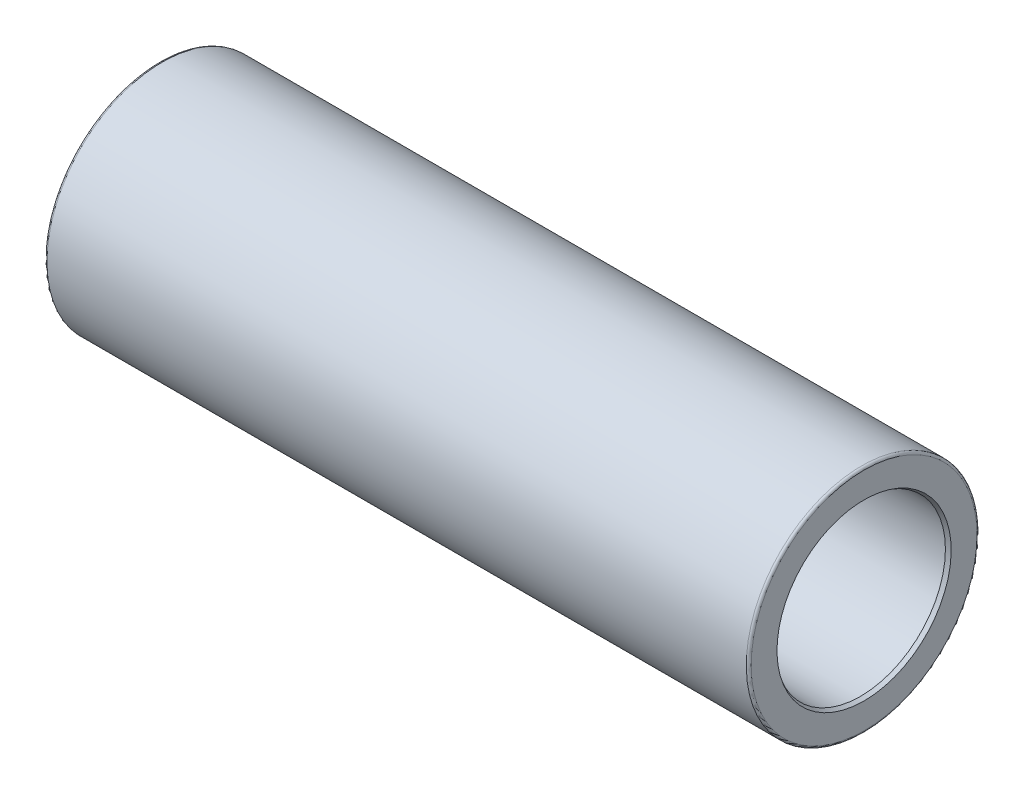
ISO-10303-21;
HEADER;
FILE_DESCRIPTION(('STEP AP214'),'2;1');
FILE_NAME('part.step','',(''),(''),'','','');
FILE_SCHEMA(('AUTOMOTIVE_DESIGN { 1 0 10303 214 1 1 1 1 }'));
ENDSEC;
DATA;
#1=APPLICATION_CONTEXT('core data for automotive mechanical design processes');
#2=APPLICATION_PROTOCOL_DEFINITION('international standard','automotive_design',2000,#1);
#3=PRODUCT_CONTEXT('',#1,'mechanical');
#4=PRODUCT('Part','Part','',(#3));
#5=PRODUCT_RELATED_PRODUCT_CATEGORY('part','',(#4));
#6=PRODUCT_DEFINITION_FORMATION('','',#4);
#7=PRODUCT_DEFINITION_CONTEXT('part definition',#1,'design');
#8=PRODUCT_DEFINITION('design','',#6,#7);
#9=PRODUCT_DEFINITION_SHAPE('','',#8);
#10=(LENGTH_UNIT() NAMED_UNIT(*) SI_UNIT(.MILLI.,.METRE.));
#11=(NAMED_UNIT(*) PLANE_ANGLE_UNIT() SI_UNIT($,.RADIAN.));
#12=(NAMED_UNIT(*) SI_UNIT($,.STERADIAN.) SOLID_ANGLE_UNIT());
#13=UNCERTAINTY_MEASURE_WITH_UNIT(LENGTH_MEASURE(1.E-05),#10,'distance_accuracy_value','');
#14=(GEOMETRIC_REPRESENTATION_CONTEXT(3) GLOBAL_UNCERTAINTY_ASSIGNED_CONTEXT((#13)) GLOBAL_UNIT_ASSIGNED_CONTEXT((#10,
#11,#12)) REPRESENTATION_CONTEXT('',''));
#15=CARTESIAN_POINT('',(0.,0.,0.));
#16=DIRECTION('',(0.,0.,1.));
#17=DIRECTION('',(1.,0.,0.));
#18=AXIS2_PLACEMENT_3D('',#15,#16,#17);
#19=CARTESIAN_POINT('',(-145.,0.,0.));
#20=DIRECTION('',(-1.,0.,0.));
#21=DIRECTION('',(0.,-1.,0.));
#22=AXIS2_PLACEMENT_3D('',#19,#20,#21);
#23=CYLINDRICAL_SURFACE('',#22,35.);
#24=CARTESIAN_POINT('',(-65.,0.,0.));
#25=DIRECTION('',(-1.,0.,0.));
#26=DIRECTION('',(0.,-1.,0.));
#27=AXIS2_PLACEMENT_3D('',#24,#25,#26);
#28=CIRCLE('',#27,35.);
#29=CARTESIAN_POINT('',(-65.,-35.,0.));
#30=VERTEX_POINT('',#29);
#31=EDGE_CURVE('E10',#30,#30,#28,.T.);
#32=ORIENTED_EDGE('',*,*,#31,.F.);
#33=EDGE_LOOP('',(#32));
#34=FACE_BOUND('',#33,.T.);
#35=CARTESIAN_POINT('',(-143.5,0.,0.));
#36=DIRECTION('',(-1.,0.,0.));
#37=DIRECTION('',(0.,-1.,0.));
#38=AXIS2_PLACEMENT_3D('',#35,#36,#37);
#39=CIRCLE('',#38,35.);
#40=CARTESIAN_POINT('',(-143.5,-35.,0.));
#41=VERTEX_POINT('',#40);
#42=EDGE_CURVE('E80',#41,#41,#39,.T.);
#43=ORIENTED_EDGE('',*,*,#42,.T.);
#44=EDGE_LOOP('',(#43));
#45=FACE_BOUND('',#44,.T.);
#46=ADVANCED_FACE('F37',(#34,#45),#23,.F.);
#47=CARTESIAN_POINT('',(-145.,35.,0.));
#48=DIRECTION('',(-1.,0.,0.));
#49=DIRECTION('',(0.,-1.,0.));
#50=AXIS2_PLACEMENT_3D('',#47,#48,#49);
#51=PLANE('',#50);
#52=CARTESIAN_POINT('',(-145.,0.,0.));
#53=DIRECTION('',(-1.,0.,0.));
#54=DIRECTION('',(0.,-1.,0.));
#55=AXIS2_PLACEMENT_3D('',#52,#53,#54);
#56=CIRCLE('',#55,46.5);
#57=CARTESIAN_POINT('',(-145.,-46.5,0.));
#58=VERTEX_POINT('',#57);
#59=EDGE_CURVE('E71',#58,#58,#56,.T.);
#60=ORIENTED_EDGE('',*,*,#59,.T.);
#61=EDGE_LOOP('',(#60));
#62=FACE_BOUND('',#61,.T.);
#63=CARTESIAN_POINT('',(-145.,0.,0.));
#64=DIRECTION('',(-1.,0.,0.));
#65=DIRECTION('',(0.,-1.,0.));
#66=AXIS2_PLACEMENT_3D('',#63,#64,#65);
#67=CIRCLE('',#66,35.8660254037845);
#68=CARTESIAN_POINT('',(-145.,-35.8660254037845,0.));
#69=VERTEX_POINT('',#68);
#70=EDGE_CURVE('E83',#69,#69,#67,.T.);
#71=ORIENTED_EDGE('',*,*,#70,.F.);
#72=EDGE_LOOP('',(#71));
#73=FACE_BOUND('',#72,.T.);
#74=ADVANCED_FACE('F90',(#62,#73),#51,.T.);
#75=CARTESIAN_POINT('',(-145.,0.,0.));
#76=DIRECTION('',(-1.,0.,0.));
#77=DIRECTION('',(0.,-1.,0.));
#78=AXIS2_PLACEMENT_3D('',#75,#76,#77);
#79=CYLINDRICAL_SURFACE('',#78,35.);
#80=CARTESIAN_POINT('',(65.,0.,0.));
#81=DIRECTION('',(-1.,0.,0.));
#82=DIRECTION('',(0.,-1.,0.));
#83=AXIS2_PLACEMENT_3D('',#80,#81,#82);
#84=CIRCLE('',#83,35.);
#85=CARTESIAN_POINT('',(65.,-35.,0.));
#86=VERTEX_POINT('',#85);
#87=EDGE_CURVE('E59',#86,#86,#84,.T.);
#88=ORIENTED_EDGE('',*,*,#87,.T.);
#89=EDGE_LOOP('',(#88));
#90=FACE_BOUND('',#89,.T.);
#91=CARTESIAN_POINT('',(143.5,0.,0.));
#92=DIRECTION('',(-1.,0.,0.));
#93=DIRECTION('',(0.,-1.,0.));
#94=AXIS2_PLACEMENT_3D('',#91,#92,#93);
#95=CIRCLE('',#94,35.);
#96=CARTESIAN_POINT('',(143.5,-35.,0.));
#97=VERTEX_POINT('',#96);
#98=EDGE_CURVE('E77',#97,#97,#95,.T.);
#99=ORIENTED_EDGE('',*,*,#98,.F.);
#100=EDGE_LOOP('',(#99));
#101=FACE_BOUND('',#100,.T.);
#102=ADVANCED_FACE('F92',(#90,#101),#79,.F.);
#103=CARTESIAN_POINT('',(145.,35.,0.));
#104=DIRECTION('',(-1.,0.,0.));
#105=DIRECTION('',(0.,-1.,0.));
#106=AXIS2_PLACEMENT_3D('',#103,#104,#105);
#107=PLANE('',#106);
#108=CARTESIAN_POINT('',(145.,0.,0.));
#109=DIRECTION('',(-1.,0.,0.));
#110=DIRECTION('',(0.,-1.,0.));
#111=AXIS2_PLACEMENT_3D('',#108,#109,#110);
#112=CIRCLE('',#111,46.5);
#113=CARTESIAN_POINT('',(145.,-46.5,0.));
#114=VERTEX_POINT('',#113);
#115=EDGE_CURVE('E62',#114,#114,#112,.T.);
#116=ORIENTED_EDGE('',*,*,#115,.F.);
#117=EDGE_LOOP('',(#116));
#118=FACE_BOUND('',#117,.T.);
#119=CARTESIAN_POINT('',(145.,0.,0.));
#120=DIRECTION('',(-1.,0.,0.));
#121=DIRECTION('',(0.,-1.,0.));
#122=AXIS2_PLACEMENT_3D('',#119,#120,#121);
#123=CIRCLE('',#122,35.8660254037845);
#124=CARTESIAN_POINT('',(145.,-35.8660254037845,0.));
#125=VERTEX_POINT('',#124);
#126=EDGE_CURVE('E74',#125,#125,#123,.T.);
#127=ORIENTED_EDGE('',*,*,#126,.T.);
#128=EDGE_LOOP('',(#127));
#129=FACE_BOUND('',#128,.T.);
#130=ADVANCED_FACE('F99',(#118,#129),#107,.F.);
#131=CARTESIAN_POINT('',(-65.,0.,0.));
#132=DIRECTION('',(1.,0.,0.));
#133=DIRECTION('',(0.,1.,0.));
#134=AXIS2_PLACEMENT_3D('',#131,#132,#133);
#135=CONICAL_SURFACE('',#134,35.,0.349065850398866);
#136=CARTESIAN_POINT('',(-58.2969996139807,0.,0.));
#137=DIRECTION('',(-1.,0.,0.));
#138=DIRECTION('',(0.,-1.,0.));
#139=AXIS2_PLACEMENT_3D('',#136,#137,#138);
#140=CIRCLE('',#139,37.4396926207859);
#141=CARTESIAN_POINT('',(-58.2969996139807,-37.4396926207859,0.));
#142=VERTEX_POINT('',#141);
#143=EDGE_CURVE('E43',#142,#142,#140,.T.);
#144=ORIENTED_EDGE('',*,*,#143,.F.);
#145=EDGE_LOOP('',(#144));
#146=FACE_BOUND('',#145,.T.);
#147=ORIENTED_EDGE('',*,*,#31,.T.);
#148=EDGE_LOOP('',(#147));
#149=FACE_BOUND('',#148,.T.);
#150=ADVANCED_FACE('F121',(#146,#149),#135,.F.);
#151=CARTESIAN_POINT('',(-57.954979470655,0.,0.));
#152=DIRECTION('',(-1.,0.,0.));
#153=DIRECTION('',(0.,-1.,0.));
#154=AXIS2_PLACEMENT_3D('',#151,#152,#153);
#155=TOROIDAL_SURFACE('',#154,36.5,1.);
#156=ORIENTED_EDGE('',*,*,#143,.T.);
#157=EDGE_LOOP('',(#156));
#158=FACE_BOUND('',#157,.T.);
#159=CARTESIAN_POINT('',(-57.954979470655,0.,0.));
#160=DIRECTION('',(-1.,0.,0.));
#161=DIRECTION('',(0.,-1.,0.));
#162=AXIS2_PLACEMENT_3D('',#159,#160,#161);
#163=CIRCLE('',#162,37.5);
#164=CARTESIAN_POINT('',(-57.954979470655,-37.5,0.));
#165=VERTEX_POINT('',#164);
#166=EDGE_CURVE('E47',#165,#165,#163,.T.);
#167=ORIENTED_EDGE('',*,*,#166,.F.);
#168=EDGE_LOOP('',(#167));
#169=FACE_BOUND('',#168,.T.);
#170=ADVANCED_FACE('F134',(#158,#169),#155,.F.);
#171=CARTESIAN_POINT('',(-145.,0.,0.));
#172=DIRECTION('',(-1.,0.,0.));
#173=DIRECTION('',(0.,-1.,0.));
#174=AXIS2_PLACEMENT_3D('',#171,#172,#173);
#175=CYLINDRICAL_SURFACE('',#174,37.5);
#176=CARTESIAN_POINT('',(57.954979470655,0.,0.));
#177=DIRECTION('',(-1.,0.,0.));
#178=DIRECTION('',(0.,-1.,0.));
#179=AXIS2_PLACEMENT_3D('',#176,#177,#178);
#180=CIRCLE('',#179,37.5);
#181=CARTESIAN_POINT('',(57.954979470655,-37.5,0.));
#182=VERTEX_POINT('',#181);
#183=EDGE_CURVE('E51',#182,#182,#180,.T.);
#184=ORIENTED_EDGE('',*,*,#183,.F.);
#185=EDGE_LOOP('',(#184));
#186=FACE_BOUND('',#185,.T.);
#187=ORIENTED_EDGE('',*,*,#166,.T.);
#188=EDGE_LOOP('',(#187));
#189=FACE_BOUND('',#188,.T.);
#190=ADVANCED_FACE('F130',(#186,#189),#175,.F.);
#191=CARTESIAN_POINT('',(57.954979470655,0.,0.));
#192=DIRECTION('',(-1.,0.,0.));
#193=DIRECTION('',(0.,-1.,0.));
#194=AXIS2_PLACEMENT_3D('',#191,#192,#193);
#195=TOROIDAL_SURFACE('',#194,36.5,1.);
#196=CARTESIAN_POINT('',(58.2969996139807,0.,0.));
#197=DIRECTION('',(-1.,0.,0.));
#198=DIRECTION('',(0.,-1.,0.));
#199=AXIS2_PLACEMENT_3D('',#196,#197,#198);
#200=CIRCLE('',#199,37.4396926207859);
#201=CARTESIAN_POINT('',(58.2969996139807,-37.4396926207859,0.));
#202=VERTEX_POINT('',#201);
#203=EDGE_CURVE('E56',#202,#202,#200,.T.);
#204=ORIENTED_EDGE('',*,*,#203,.F.);
#205=EDGE_LOOP('',(#204));
#206=FACE_BOUND('',#205,.T.);
#207=ORIENTED_EDGE('',*,*,#183,.T.);
#208=EDGE_LOOP('',(#207));
#209=FACE_BOUND('',#208,.T.);
#210=ADVANCED_FACE('F126',(#206,#209),#195,.F.);
#211=CARTESIAN_POINT('',(65.,0.,0.));
#212=DIRECTION('',(-1.,0.,0.));
#213=DIRECTION('',(0.,-1.,0.));
#214=AXIS2_PLACEMENT_3D('',#211,#212,#213);
#215=CONICAL_SURFACE('',#214,35.,0.349065850398866);
#216=ORIENTED_EDGE('',*,*,#203,.T.);
#217=EDGE_LOOP('',(#216));
#218=FACE_BOUND('',#217,.T.);
#219=ORIENTED_EDGE('',*,*,#87,.F.);
#220=EDGE_LOOP('',(#219));
#221=FACE_BOUND('',#220,.T.);
#222=ADVANCED_FACE('F118',(#218,#221),#215,.F.);
#223=CARTESIAN_POINT('',(144.,0.,0.));
#224=DIRECTION('',(-1.,0.,0.));
#225=DIRECTION('',(0.,-1.,0.));
#226=AXIS2_PLACEMENT_3D('',#223,#224,#225);
#227=TOROIDAL_SURFACE('',#226,46.5,1.);
#228=ORIENTED_EDGE('',*,*,#115,.T.);
#229=EDGE_LOOP('',(#228));
#230=FACE_BOUND('',#229,.T.);
#231=CARTESIAN_POINT('',(144.,0.,0.));
#232=DIRECTION('',(-1.,0.,0.));
#233=DIRECTION('',(0.,-1.,0.));
#234=AXIS2_PLACEMENT_3D('',#231,#232,#233);
#235=CIRCLE('',#234,47.5);
#236=CARTESIAN_POINT('',(144.,-47.5,0.));
#237=VERTEX_POINT('',#236);
#238=EDGE_CURVE('E65',#237,#237,#235,.T.);
#239=ORIENTED_EDGE('',*,*,#238,.F.);
#240=EDGE_LOOP('',(#239));
#241=FACE_BOUND('',#240,.T.);
#242=ADVANCED_FACE('F114',(#230,#241),#227,.T.);
#243=CARTESIAN_POINT('',(-145.,0.,0.));
#244=DIRECTION('',(-1.,0.,0.));
#245=DIRECTION('',(0.,-1.,0.));
#246=AXIS2_PLACEMENT_3D('',#243,#244,#245);
#247=CYLINDRICAL_SURFACE('',#246,47.5);
#248=ORIENTED_EDGE('',*,*,#238,.T.);
#249=EDGE_LOOP('',(#248));
#250=FACE_BOUND('',#249,.T.);
#251=CARTESIAN_POINT('',(-144.,0.,0.));
#252=DIRECTION('',(-1.,0.,0.));
#253=DIRECTION('',(0.,-1.,0.));
#254=AXIS2_PLACEMENT_3D('',#251,#252,#253);
#255=CIRCLE('',#254,47.5);
#256=CARTESIAN_POINT('',(-144.,-47.5,0.));
#257=VERTEX_POINT('',#256);
#258=EDGE_CURVE('E68',#257,#257,#255,.T.);
#259=ORIENTED_EDGE('',*,*,#258,.F.);
#260=EDGE_LOOP('',(#259));
#261=FACE_BOUND('',#260,.T.);
#262=ADVANCED_FACE('F110',(#250,#261),#247,.T.);
#263=CARTESIAN_POINT('',(-144.,0.,0.));
#264=DIRECTION('',(-1.,0.,0.));
#265=DIRECTION('',(0.,-1.,0.));
#266=AXIS2_PLACEMENT_3D('',#263,#264,#265);
#267=TOROIDAL_SURFACE('',#266,46.5,1.);
#268=ORIENTED_EDGE('',*,*,#59,.F.);
#269=EDGE_LOOP('',(#268));
#270=FACE_BOUND('',#269,.T.);
#271=ORIENTED_EDGE('',*,*,#258,.T.);
#272=EDGE_LOOP('',(#271));
#273=FACE_BOUND('',#272,.T.);
#274=ADVANCED_FACE('F107',(#270,#273),#267,.T.);
#275=CARTESIAN_POINT('',(145.,0.,0.));
#276=DIRECTION('',(1.,0.,0.));
#277=DIRECTION('',(0.,1.,0.));
#278=AXIS2_PLACEMENT_3D('',#275,#276,#277);
#279=CONICAL_SURFACE('',#278,35.8660254037845,0.523598775598301);
#280=ORIENTED_EDGE('',*,*,#98,.T.);
#281=EDGE_LOOP('',(#280));
#282=FACE_BOUND('',#281,.T.);
#283=ORIENTED_EDGE('',*,*,#126,.F.);
#284=EDGE_LOOP('',(#283));
#285=FACE_BOUND('',#284,.T.);
#286=ADVANCED_FACE('F105',(#282,#285),#279,.F.);
#287=CARTESIAN_POINT('',(-143.5,0.,0.));
#288=DIRECTION('',(-1.,0.,0.));
#289=DIRECTION('',(0.,-1.,0.));
#290=AXIS2_PLACEMENT_3D('',#287,#288,#289);
#291=CONICAL_SURFACE('',#290,35.,0.523598775598301);
#292=ORIENTED_EDGE('',*,*,#70,.T.);
#293=EDGE_LOOP('',(#292));
#294=FACE_BOUND('',#293,.T.);
#295=ORIENTED_EDGE('',*,*,#42,.F.);
#296=EDGE_LOOP('',(#295));
#297=FACE_BOUND('',#296,.T.);
#298=ADVANCED_FACE('F87',(#294,#297),#291,.F.);
#299=CLOSED_SHELL('',(#46,#74,#102,#130,#150,#170,#190,#210,#222,#242,#262,#274,#286,#298));
#300=MANIFOLD_SOLID_BREP('B2',#299);
#301=ADVANCED_BREP_SHAPE_REPRESENTATION('',(#18,#300),#14);
#302=SHAPE_DEFINITION_REPRESENTATION(#9,#301);
ENDSEC;
END-ISO-10303-21;
